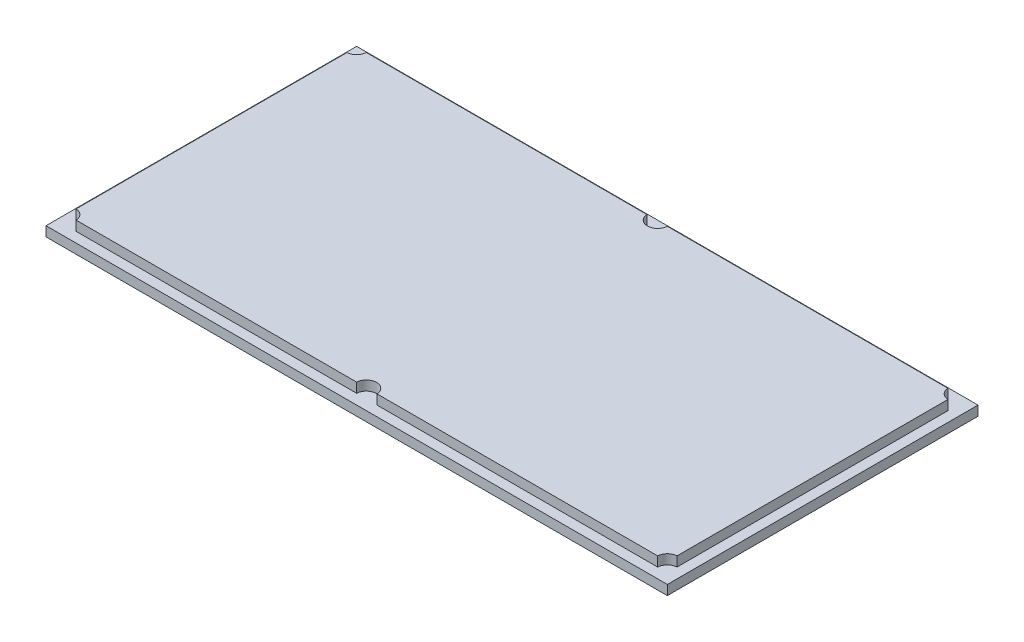
ISO-10303-21;
HEADER;
FILE_DESCRIPTION(('STEP AP214'),'2;1');
FILE_NAME('part.step','',(''),(''),'','','');
FILE_SCHEMA(('AUTOMOTIVE_DESIGN { 1 0 10303 214 1 1 1 1 }'));
ENDSEC;
DATA;
#1=APPLICATION_CONTEXT('core data for automotive mechanical design processes');
#2=APPLICATION_PROTOCOL_DEFINITION('international standard','automotive_design',2000,#1);
#3=PRODUCT_CONTEXT('',#1,'mechanical');
#4=PRODUCT('Part','Part','',(#3));
#5=PRODUCT_RELATED_PRODUCT_CATEGORY('part','',(#4));
#6=PRODUCT_DEFINITION_FORMATION('','',#4);
#7=PRODUCT_DEFINITION_CONTEXT('part definition',#1,'design');
#8=PRODUCT_DEFINITION('design','',#6,#7);
#9=PRODUCT_DEFINITION_SHAPE('','',#8);
#10=(LENGTH_UNIT() NAMED_UNIT(*) SI_UNIT(.MILLI.,.METRE.));
#11=(NAMED_UNIT(*) PLANE_ANGLE_UNIT() SI_UNIT($,.RADIAN.));
#12=(NAMED_UNIT(*) SI_UNIT($,.STERADIAN.) SOLID_ANGLE_UNIT());
#13=UNCERTAINTY_MEASURE_WITH_UNIT(LENGTH_MEASURE(1.E-05),#10,'distance_accuracy_value','');
#14=(GEOMETRIC_REPRESENTATION_CONTEXT(3) GLOBAL_UNCERTAINTY_ASSIGNED_CONTEXT((#13)) GLOBAL_UNIT_ASSIGNED_CONTEXT((#10,
#11,#12)) REPRESENTATION_CONTEXT('',''));
#15=CARTESIAN_POINT('',(0.,0.,0.));
#16=DIRECTION('',(0.,0.,1.));
#17=DIRECTION('',(1.,0.,0.));
#18=AXIS2_PLACEMENT_3D('',#15,#16,#17);
#19=CARTESIAN_POINT('',(0.,2.,136.));
#20=DIRECTION('',(0.,0.,1.));
#21=DIRECTION('',(1.,0.,0.));
#22=AXIS2_PLACEMENT_3D('',#19,#20,#21);
#23=PLANE('',#22);
#24=DIRECTION('',(-1.,0.,0.));
#25=VECTOR('',#24,1.);
#26=CARTESIAN_POINT('',(0.,0.,136.));
#27=LINE('',#26,#25);
#28=CARTESIAN_POINT('',(64.,0.,136.));
#29=VERTEX_POINT('',#28);
#30=CARTESIAN_POINT('',(-64.,0.,136.));
#31=VERTEX_POINT('',#30);
#32=EDGE_CURVE('E164',#29,#31,#27,.T.);
#33=ORIENTED_EDGE('',*,*,#32,.F.);
#34=DIRECTION('',(0.,-1.,0.));
#35=VECTOR('',#34,1.);
#36=CARTESIAN_POINT('',(64.,2.,136.));
#37=LINE('',#36,#35);
#38=CARTESIAN_POINT('',(64.,2.,136.));
#39=VERTEX_POINT('',#38);
#40=EDGE_CURVE('E11',#39,#29,#37,.T.);
#41=ORIENTED_EDGE('',*,*,#40,.F.);
#42=DIRECTION('',(-1.,0.,0.));
#43=VECTOR('',#42,1.);
#44=CARTESIAN_POINT('',(0.,2.,136.));
#45=LINE('',#44,#43);
#46=CARTESIAN_POINT('',(-64.,2.,136.));
#47=VERTEX_POINT('',#46);
#48=EDGE_CURVE('E178',#39,#47,#45,.T.);
#49=ORIENTED_EDGE('',*,*,#48,.T.);
#50=DIRECTION('',(0.,-1.,0.));
#51=VECTOR('',#50,1.);
#52=CARTESIAN_POINT('',(-64.,2.,136.));
#53=LINE('',#52,#51);
#54=EDGE_CURVE('E83',#47,#31,#53,.T.);
#55=ORIENTED_EDGE('',*,*,#54,.T.);
#56=EDGE_LOOP('',(#33,#41,#49,#55));
#57=FACE_BOUND('',#56,.T.);
#58=ADVANCED_FACE('F41',(#57),#23,.T.);
#59=CARTESIAN_POINT('',(64.,2.,0.));
#60=DIRECTION('',(1.,0.,0.));
#61=DIRECTION('',(0.,0.,-1.));
#62=AXIS2_PLACEMENT_3D('',#59,#60,#61);
#63=PLANE('',#62);
#64=DIRECTION('',(0.,0.,1.));
#65=VECTOR('',#64,1.);
#66=CARTESIAN_POINT('',(64.,0.,0.));
#67=LINE('',#66,#65);
#68=CARTESIAN_POINT('',(64.,0.,72.0000000000001));
#69=VERTEX_POINT('',#68);
#70=EDGE_CURVE('E168',#69,#29,#67,.T.);
#71=ORIENTED_EDGE('',*,*,#70,.F.);
#72=DIRECTION('',(0.,-1.,0.));
#73=VECTOR('',#72,1.);
#74=CARTESIAN_POINT('',(64.,2.,72.0000000000001));
#75=LINE('',#74,#73);
#76=CARTESIAN_POINT('',(64.,2.,72.0000000000001));
#77=VERTEX_POINT('',#76);
#78=EDGE_CURVE('E50',#77,#69,#75,.T.);
#79=ORIENTED_EDGE('',*,*,#78,.F.);
#80=DIRECTION('',(0.,0.,1.));
#81=VECTOR('',#80,1.);
#82=CARTESIAN_POINT('',(64.,2.,0.));
#83=LINE('',#82,#81);
#84=EDGE_CURVE('E103',#77,#39,#83,.T.);
#85=ORIENTED_EDGE('',*,*,#84,.T.);
#86=ORIENTED_EDGE('',*,*,#40,.T.);
#87=EDGE_LOOP('',(#71,#79,#85,#86));
#88=FACE_BOUND('',#87,.T.);
#89=ADVANCED_FACE('F185',(#88),#63,.T.);
#90=CARTESIAN_POINT('',(0.,2.,72.0000000000001));
#91=DIRECTION('',(0.,0.,1.));
#92=DIRECTION('',(1.,0.,0.));
#93=AXIS2_PLACEMENT_3D('',#90,#91,#92);
#94=PLANE('',#93);
#95=DIRECTION('',(-1.,0.,0.));
#96=VECTOR('',#95,1.);
#97=CARTESIAN_POINT('',(0.,0.,72.0000000000001));
#98=LINE('',#97,#96);
#99=CARTESIAN_POINT('',(-64.,0.,72.0000000000001));
#100=VERTEX_POINT('',#99);
#101=EDGE_CURVE('E75',#69,#100,#98,.T.);
#102=ORIENTED_EDGE('',*,*,#101,.T.);
#103=DIRECTION('',(0.,-1.,0.));
#104=VECTOR('',#103,1.);
#105=CARTESIAN_POINT('',(-64.,2.,72.0000000000001));
#106=LINE('',#105,#104);
#107=CARTESIAN_POINT('',(-64.,2.,72.0000000000001));
#108=VERTEX_POINT('',#107);
#109=EDGE_CURVE('E106',#108,#100,#106,.T.);
#110=ORIENTED_EDGE('',*,*,#109,.F.);
#111=DIRECTION('',(-1.,0.,0.));
#112=VECTOR('',#111,1.);
#113=CARTESIAN_POINT('',(0.,2.,72.0000000000001));
#114=LINE('',#113,#112);
#115=EDGE_CURVE('E97',#77,#108,#114,.T.);
#116=ORIENTED_EDGE('',*,*,#115,.F.);
#117=ORIENTED_EDGE('',*,*,#78,.T.);
#118=EDGE_LOOP('',(#102,#110,#116,#117));
#119=FACE_BOUND('',#118,.T.);
#120=ADVANCED_FACE('F107',(#119),#94,.F.);
#121=CARTESIAN_POINT('',(-64.,2.,0.));
#122=DIRECTION('',(1.,0.,0.));
#123=DIRECTION('',(0.,0.,-1.));
#124=AXIS2_PLACEMENT_3D('',#121,#122,#123);
#125=PLANE('',#124);
#126=DIRECTION('',(0.,0.,1.));
#127=VECTOR('',#126,1.);
#128=CARTESIAN_POINT('',(-64.,0.,0.));
#129=LINE('',#128,#127);
#130=EDGE_CURVE('E175',#100,#31,#129,.T.);
#131=ORIENTED_EDGE('',*,*,#130,.T.);
#132=ORIENTED_EDGE('',*,*,#54,.F.);
#133=DIRECTION('',(0.,0.,1.));
#134=VECTOR('',#133,1.);
#135=CARTESIAN_POINT('',(-64.,2.,0.));
#136=LINE('',#135,#134);
#137=EDGE_CURVE('E101',#108,#47,#136,.T.);
#138=ORIENTED_EDGE('',*,*,#137,.F.);
#139=ORIENTED_EDGE('',*,*,#109,.T.);
#140=EDGE_LOOP('',(#131,#132,#138,#139));
#141=FACE_BOUND('',#140,.T.);
#142=ADVANCED_FACE('F112',(#141),#125,.F.);
#143=CARTESIAN_POINT('',(0.,2.,0.));
#144=DIRECTION('',(0.,1.,0.));
#145=DIRECTION('',(0.,0.,1.));
#146=AXIS2_PLACEMENT_3D('',#143,#144,#145);
#147=PLANE('',#146);
#148=ORIENTED_EDGE('',*,*,#48,.F.);
#149=ORIENTED_EDGE('',*,*,#84,.F.);
#150=ORIENTED_EDGE('',*,*,#115,.T.);
#151=ORIENTED_EDGE('',*,*,#137,.T.);
#152=EDGE_LOOP('',(#148,#149,#150,#151));
#153=FACE_BOUND('',#152,.T.);
#154=CARTESIAN_POINT('',(-62.,2.,134.));
#155=DIRECTION('',(0.,1.,0.));
#156=DIRECTION('',(0.,0.,1.));
#157=AXIS2_PLACEMENT_3D('',#154,#155,#156);
#158=CIRCLE('',#157,2.10000000000001);
#159=CARTESIAN_POINT('',(-61.9,2.,131.90238230366));
#160=VERTEX_POINT('',#159);
#161=CARTESIAN_POINT('',(-59.9023823036597,2.,133.9));
#162=VERTEX_POINT('',#161);
#163=EDGE_CURVE('E114',#160,#162,#158,.F.);
#164=ORIENTED_EDGE('',*,*,#163,.F.);
#165=DIRECTION('',(0.,0.,1.));
#166=VECTOR('',#165,1.);
#167=CARTESIAN_POINT('',(-61.9,2.,0.));
#168=LINE('',#167,#166);
#169=CARTESIAN_POINT('',(-61.9,2.,76.0976176963403));
#170=VERTEX_POINT('',#169);
#171=EDGE_CURVE('E118',#170,#160,#168,.T.);
#172=ORIENTED_EDGE('',*,*,#171,.F.);
#173=CARTESIAN_POINT('',(-62.,2.,74.0000000000001));
#174=DIRECTION('',(0.,1.,0.));
#175=DIRECTION('',(0.,0.,1.));
#176=AXIS2_PLACEMENT_3D('',#173,#174,#175);
#177=CIRCLE('',#176,2.09999999999998);
#178=CARTESIAN_POINT('',(-59.9023823036597,2.,74.1000000000001));
#179=VERTEX_POINT('',#178);
#180=EDGE_CURVE('E125',#170,#179,#177,.T.);
#181=ORIENTED_EDGE('',*,*,#180,.T.);
#182=DIRECTION('',(-1.,0.,0.));
#183=VECTOR('',#182,1.);
#184=CARTESIAN_POINT('',(0.,2.,74.1000000000001));
#185=LINE('',#184,#183);
#186=CARTESIAN_POINT('',(-2.0976176963403,2.,74.1000000000001));
#187=VERTEX_POINT('',#186);
#188=EDGE_CURVE('E129',#187,#179,#185,.T.);
#189=ORIENTED_EDGE('',*,*,#188,.F.);
#190=CARTESIAN_POINT('',(0.,2.,74.0000000000001));
#191=DIRECTION('',(0.,1.,0.));
#192=DIRECTION('',(0.,0.,1.));
#193=AXIS2_PLACEMENT_3D('',#190,#191,#192);
#194=CIRCLE('',#193,2.1);
#195=CARTESIAN_POINT('',(2.0976176963403,2.,74.1000000000001));
#196=VERTEX_POINT('',#195);
#197=EDGE_CURVE('E132',#196,#187,#194,.F.);
#198=ORIENTED_EDGE('',*,*,#197,.F.);
#199=DIRECTION('',(-1.,0.,0.));
#200=VECTOR('',#199,1.);
#201=CARTESIAN_POINT('',(0.,2.,74.1000000000001));
#202=LINE('',#201,#200);
#203=CARTESIAN_POINT('',(59.9023823036597,2.,74.1000000000001));
#204=VERTEX_POINT('',#203);
#205=EDGE_CURVE('E136',#204,#196,#202,.T.);
#206=ORIENTED_EDGE('',*,*,#205,.F.);
#207=CARTESIAN_POINT('',(62.,2.,74.0000000000001));
#208=DIRECTION('',(0.,1.,0.));
#209=DIRECTION('',(0.,0.,1.));
#210=AXIS2_PLACEMENT_3D('',#207,#208,#209);
#211=CIRCLE('',#210,2.1);
#212=CARTESIAN_POINT('',(61.9,2.,76.0976176963404));
#213=VERTEX_POINT('',#212);
#214=EDGE_CURVE('E140',#213,#204,#211,.F.);
#215=ORIENTED_EDGE('',*,*,#214,.F.);
#216=DIRECTION('',(0.,0.,1.));
#217=VECTOR('',#216,1.);
#218=CARTESIAN_POINT('',(61.9,2.,0.));
#219=LINE('',#218,#217);
#220=CARTESIAN_POINT('',(61.9,2.,131.90238230366));
#221=VERTEX_POINT('',#220);
#222=EDGE_CURVE('E144',#213,#221,#219,.T.);
#223=ORIENTED_EDGE('',*,*,#222,.T.);
#224=CARTESIAN_POINT('',(62.,2.,134.));
#225=DIRECTION('',(0.,1.,0.));
#226=DIRECTION('',(0.,0.,1.));
#227=AXIS2_PLACEMENT_3D('',#224,#225,#226);
#228=CIRCLE('',#227,2.1);
#229=CARTESIAN_POINT('',(59.9023823036597,2.,133.9));
#230=VERTEX_POINT('',#229);
#231=EDGE_CURVE('E148',#221,#230,#228,.T.);
#232=ORIENTED_EDGE('',*,*,#231,.T.);
#233=DIRECTION('',(-1.,0.,0.));
#234=VECTOR('',#233,1.);
#235=CARTESIAN_POINT('',(0.,2.,133.9));
#236=LINE('',#235,#234);
#237=CARTESIAN_POINT('',(2.0976176963403,2.,133.9));
#238=VERTEX_POINT('',#237);
#239=EDGE_CURVE('E152',#230,#238,#236,.T.);
#240=ORIENTED_EDGE('',*,*,#239,.T.);
#241=CARTESIAN_POINT('',(0.,2.,134.));
#242=DIRECTION('',(0.,1.,0.));
#243=DIRECTION('',(0.,0.,1.));
#244=AXIS2_PLACEMENT_3D('',#241,#242,#243);
#245=CIRCLE('',#244,2.1);
#246=CARTESIAN_POINT('',(-2.0976176963403,2.,133.9));
#247=VERTEX_POINT('',#246);
#248=EDGE_CURVE('E156',#238,#247,#245,.T.);
#249=ORIENTED_EDGE('',*,*,#248,.T.);
#250=DIRECTION('',(-1.,0.,0.));
#251=VECTOR('',#250,1.);
#252=CARTESIAN_POINT('',(0.,2.,133.9));
#253=LINE('',#252,#251);
#254=EDGE_CURVE('E160',#247,#162,#253,.T.);
#255=ORIENTED_EDGE('',*,*,#254,.T.);
#256=EDGE_LOOP('',(#164,#172,#181,#189,#198,#206,#215,#223,#232,#240,#249,#255));
#257=FACE_BOUND('',#256,.T.);
#258=ADVANCED_FACE('F98',(#153,#257),#147,.T.);
#259=CARTESIAN_POINT('',(0.,0.,0.));
#260=DIRECTION('',(0.,1.,0.));
#261=DIRECTION('',(0.,0.,1.));
#262=AXIS2_PLACEMENT_3D('',#259,#260,#261);
#263=PLANE('',#262);
#264=ORIENTED_EDGE('',*,*,#32,.T.);
#265=ORIENTED_EDGE('',*,*,#130,.F.);
#266=ORIENTED_EDGE('',*,*,#101,.F.);
#267=ORIENTED_EDGE('',*,*,#70,.T.);
#268=EDGE_LOOP('',(#264,#265,#266,#267));
#269=FACE_BOUND('',#268,.T.);
#270=ADVANCED_FACE('F184',(#269),#263,.F.);
#271=CARTESIAN_POINT('',(-61.9,4.,0.));
#272=DIRECTION('',(1.,0.,0.));
#273=DIRECTION('',(0.,0.,-1.));
#274=AXIS2_PLACEMENT_3D('',#271,#272,#273);
#275=PLANE('',#274);
#276=ORIENTED_EDGE('',*,*,#171,.T.);
#277=DIRECTION('',(0.,-1.,0.));
#278=VECTOR('',#277,1.);
#279=CARTESIAN_POINT('',(-61.9,4.,131.90238230366));
#280=LINE('',#279,#278);
#281=CARTESIAN_POINT('',(-61.9,4.,131.90238230366));
#282=VERTEX_POINT('',#281);
#283=EDGE_CURVE('E169',#282,#160,#280,.T.);
#284=ORIENTED_EDGE('',*,*,#283,.F.);
#285=DIRECTION('',(0.,0.,1.));
#286=VECTOR('',#285,1.);
#287=CARTESIAN_POINT('',(-61.9,4.,0.));
#288=LINE('',#287,#286);
#289=CARTESIAN_POINT('',(-61.9,4.,76.0976176963403));
#290=VERTEX_POINT('',#289);
#291=EDGE_CURVE('E258',#290,#282,#288,.T.);
#292=ORIENTED_EDGE('',*,*,#291,.F.);
#293=DIRECTION('',(0.,-1.,0.));
#294=VECTOR('',#293,1.);
#295=CARTESIAN_POINT('',(-61.9,4.,76.0976176963403));
#296=LINE('',#295,#294);
#297=EDGE_CURVE('E319',#290,#170,#296,.T.);
#298=ORIENTED_EDGE('',*,*,#297,.T.);
#299=EDGE_LOOP('',(#276,#284,#292,#298));
#300=FACE_BOUND('',#299,.T.);
#301=ADVANCED_FACE('F199',(#300),#275,.F.);
#302=CARTESIAN_POINT('',(-62.,4.,134.));
#303=DIRECTION('',(0.,-1.,0.));
#304=DIRECTION('',(0.,0.,-1.));
#305=AXIS2_PLACEMENT_3D('',#302,#303,#304);
#306=CYLINDRICAL_SURFACE('',#305,2.10000000000001);
#307=ORIENTED_EDGE('',*,*,#163,.T.);
#308=DIRECTION('',(0.,-1.,0.));
#309=VECTOR('',#308,1.);
#310=CARTESIAN_POINT('',(-59.9023823036597,4.,133.9));
#311=LINE('',#310,#309);
#312=CARTESIAN_POINT('',(-59.9023823036597,4.,133.9));
#313=VERTEX_POINT('',#312);
#314=EDGE_CURVE('E276',#313,#162,#311,.T.);
#315=ORIENTED_EDGE('',*,*,#314,.F.);
#316=CARTESIAN_POINT('',(-62.,4.,134.));
#317=DIRECTION('',(0.,1.,0.));
#318=DIRECTION('',(0.,0.,1.));
#319=AXIS2_PLACEMENT_3D('',#316,#317,#318);
#320=CIRCLE('',#319,2.10000000000001);
#321=EDGE_CURVE('E263',#282,#313,#320,.F.);
#322=ORIENTED_EDGE('',*,*,#321,.F.);
#323=ORIENTED_EDGE('',*,*,#283,.T.);
#324=EDGE_LOOP('',(#307,#315,#322,#323));
#325=FACE_BOUND('',#324,.T.);
#326=ADVANCED_FACE('F204',(#325),#306,.F.);
#327=CARTESIAN_POINT('',(0.,4.,133.9));
#328=DIRECTION('',(0.,0.,1.));
#329=DIRECTION('',(1.,0.,0.));
#330=AXIS2_PLACEMENT_3D('',#327,#328,#329);
#331=PLANE('',#330);
#332=ORIENTED_EDGE('',*,*,#314,.T.);
#333=ORIENTED_EDGE('',*,*,#254,.F.);
#334=DIRECTION('',(0.,-1.,0.));
#335=VECTOR('',#334,1.);
#336=CARTESIAN_POINT('',(-2.0976176963403,4.,133.9));
#337=LINE('',#336,#335);
#338=CARTESIAN_POINT('',(-2.0976176963403,4.,133.9));
#339=VERTEX_POINT('',#338);
#340=EDGE_CURVE('E280',#339,#247,#337,.T.);
#341=ORIENTED_EDGE('',*,*,#340,.F.);
#342=DIRECTION('',(-1.,0.,0.));
#343=VECTOR('',#342,1.);
#344=CARTESIAN_POINT('',(0.,4.,133.9));
#345=LINE('',#344,#343);
#346=EDGE_CURVE('E355',#339,#313,#345,.T.);
#347=ORIENTED_EDGE('',*,*,#346,.T.);
#348=EDGE_LOOP('',(#332,#333,#341,#347));
#349=FACE_BOUND('',#348,.T.);
#350=ADVANCED_FACE('F208',(#349),#331,.T.);
#351=CARTESIAN_POINT('',(0.,4.,134.));
#352=DIRECTION('',(0.,-1.,0.));
#353=DIRECTION('',(0.,0.,-1.));
#354=AXIS2_PLACEMENT_3D('',#351,#352,#353);
#355=CYLINDRICAL_SURFACE('',#354,2.1);
#356=ORIENTED_EDGE('',*,*,#340,.T.);
#357=ORIENTED_EDGE('',*,*,#248,.F.);
#358=DIRECTION('',(0.,-1.,0.));
#359=VECTOR('',#358,1.);
#360=CARTESIAN_POINT('',(2.0976176963403,4.,133.9));
#361=LINE('',#360,#359);
#362=CARTESIAN_POINT('',(2.0976176963403,4.,133.9));
#363=VERTEX_POINT('',#362);
#364=EDGE_CURVE('E289',#363,#238,#361,.T.);
#365=ORIENTED_EDGE('',*,*,#364,.F.);
#366=CARTESIAN_POINT('',(0.,4.,134.));
#367=DIRECTION('',(0.,1.,0.));
#368=DIRECTION('',(0.,0.,1.));
#369=AXIS2_PLACEMENT_3D('',#366,#367,#368);
#370=CIRCLE('',#369,2.1);
#371=EDGE_CURVE('E351',#363,#339,#370,.T.);
#372=ORIENTED_EDGE('',*,*,#371,.T.);
#373=EDGE_LOOP('',(#356,#357,#365,#372));
#374=FACE_BOUND('',#373,.T.);
#375=ADVANCED_FACE('F212',(#374),#355,.F.);
#376=CARTESIAN_POINT('',(0.,4.,133.9));
#377=DIRECTION('',(0.,0.,1.));
#378=DIRECTION('',(1.,0.,0.));
#379=AXIS2_PLACEMENT_3D('',#376,#377,#378);
#380=PLANE('',#379);
#381=ORIENTED_EDGE('',*,*,#364,.T.);
#382=ORIENTED_EDGE('',*,*,#239,.F.);
#383=DIRECTION('',(0.,-1.,0.));
#384=VECTOR('',#383,1.);
#385=CARTESIAN_POINT('',(59.9023823036597,4.,133.9));
#386=LINE('',#385,#384);
#387=CARTESIAN_POINT('',(59.9023823036597,4.,133.9));
#388=VERTEX_POINT('',#387);
#389=EDGE_CURVE('E293',#388,#230,#386,.T.);
#390=ORIENTED_EDGE('',*,*,#389,.F.);
#391=DIRECTION('',(-1.,0.,0.));
#392=VECTOR('',#391,1.);
#393=CARTESIAN_POINT('',(0.,4.,133.9));
#394=LINE('',#393,#392);
#395=EDGE_CURVE('E347',#388,#363,#394,.T.);
#396=ORIENTED_EDGE('',*,*,#395,.T.);
#397=EDGE_LOOP('',(#381,#382,#390,#396));
#398=FACE_BOUND('',#397,.T.);
#399=ADVANCED_FACE('F216',(#398),#380,.T.);
#400=CARTESIAN_POINT('',(62.,4.,134.));
#401=DIRECTION('',(0.,-1.,0.));
#402=DIRECTION('',(0.,0.,-1.));
#403=AXIS2_PLACEMENT_3D('',#400,#401,#402);
#404=CYLINDRICAL_SURFACE('',#403,2.1);
#405=ORIENTED_EDGE('',*,*,#389,.T.);
#406=ORIENTED_EDGE('',*,*,#231,.F.);
#407=DIRECTION('',(0.,-1.,0.));
#408=VECTOR('',#407,1.);
#409=CARTESIAN_POINT('',(61.9,4.,131.90238230366));
#410=LINE('',#409,#408);
#411=CARTESIAN_POINT('',(61.9,4.,131.90238230366));
#412=VERTEX_POINT('',#411);
#413=EDGE_CURVE('E297',#412,#221,#410,.T.);
#414=ORIENTED_EDGE('',*,*,#413,.F.);
#415=CARTESIAN_POINT('',(62.,4.,134.));
#416=DIRECTION('',(0.,1.,0.));
#417=DIRECTION('',(0.,0.,1.));
#418=AXIS2_PLACEMENT_3D('',#415,#416,#417);
#419=CIRCLE('',#418,2.1);
#420=EDGE_CURVE('E343',#412,#388,#419,.T.);
#421=ORIENTED_EDGE('',*,*,#420,.T.);
#422=EDGE_LOOP('',(#405,#406,#414,#421));
#423=FACE_BOUND('',#422,.T.);
#424=ADVANCED_FACE('F220',(#423),#404,.F.);
#425=CARTESIAN_POINT('',(61.9,4.,0.));
#426=DIRECTION('',(1.,0.,0.));
#427=DIRECTION('',(0.,0.,-1.));
#428=AXIS2_PLACEMENT_3D('',#425,#426,#427);
#429=PLANE('',#428);
#430=ORIENTED_EDGE('',*,*,#413,.T.);
#431=ORIENTED_EDGE('',*,*,#222,.F.);
#432=DIRECTION('',(0.,-1.,0.));
#433=VECTOR('',#432,1.);
#434=CARTESIAN_POINT('',(61.9,4.,76.0976176963404));
#435=LINE('',#434,#433);
#436=CARTESIAN_POINT('',(61.9,4.,76.0976176963404));
#437=VERTEX_POINT('',#436);
#438=EDGE_CURVE('E301',#437,#213,#435,.T.);
#439=ORIENTED_EDGE('',*,*,#438,.F.);
#440=DIRECTION('',(0.,0.,1.));
#441=VECTOR('',#440,1.);
#442=CARTESIAN_POINT('',(61.9,4.,0.));
#443=LINE('',#442,#441);
#444=EDGE_CURVE('E339',#437,#412,#443,.T.);
#445=ORIENTED_EDGE('',*,*,#444,.T.);
#446=EDGE_LOOP('',(#430,#431,#439,#445));
#447=FACE_BOUND('',#446,.T.);
#448=ADVANCED_FACE('F224',(#447),#429,.T.);
#449=CARTESIAN_POINT('',(62.,4.,74.0000000000001));
#450=DIRECTION('',(0.,-1.,0.));
#451=DIRECTION('',(0.,0.,-1.));
#452=AXIS2_PLACEMENT_3D('',#449,#450,#451);
#453=CYLINDRICAL_SURFACE('',#452,2.1);
#454=ORIENTED_EDGE('',*,*,#214,.T.);
#455=DIRECTION('',(0.,-1.,0.));
#456=VECTOR('',#455,1.);
#457=CARTESIAN_POINT('',(59.9023823036597,4.,74.1000000000001));
#458=LINE('',#457,#456);
#459=CARTESIAN_POINT('',(59.9023823036597,4.,74.1000000000001));
#460=VERTEX_POINT('',#459);
#461=EDGE_CURVE('E305',#460,#204,#458,.T.);
#462=ORIENTED_EDGE('',*,*,#461,.F.);
#463=CARTESIAN_POINT('',(62.,4.,74.0000000000001));
#464=DIRECTION('',(0.,1.,0.));
#465=DIRECTION('',(0.,0.,1.));
#466=AXIS2_PLACEMENT_3D('',#463,#464,#465);
#467=CIRCLE('',#466,2.1);
#468=EDGE_CURVE('E335',#437,#460,#467,.F.);
#469=ORIENTED_EDGE('',*,*,#468,.F.);
#470=ORIENTED_EDGE('',*,*,#438,.T.);
#471=EDGE_LOOP('',(#454,#462,#469,#470));
#472=FACE_BOUND('',#471,.T.);
#473=ADVANCED_FACE('F228',(#472),#453,.F.);
#474=CARTESIAN_POINT('',(0.,4.,74.1000000000001));
#475=DIRECTION('',(0.,0.,1.));
#476=DIRECTION('',(1.,0.,0.));
#477=AXIS2_PLACEMENT_3D('',#474,#475,#476);
#478=PLANE('',#477);
#479=ORIENTED_EDGE('',*,*,#205,.T.);
#480=DIRECTION('',(0.,-1.,0.));
#481=VECTOR('',#480,1.);
#482=CARTESIAN_POINT('',(2.0976176963403,4.,74.1000000000001));
#483=LINE('',#482,#481);
#484=CARTESIAN_POINT('',(2.0976176963403,4.,74.1000000000001));
#485=VERTEX_POINT('',#484);
#486=EDGE_CURVE('E309',#485,#196,#483,.T.);
#487=ORIENTED_EDGE('',*,*,#486,.F.);
#488=DIRECTION('',(-1.,0.,0.));
#489=VECTOR('',#488,1.);
#490=CARTESIAN_POINT('',(0.,4.,74.1000000000001));
#491=LINE('',#490,#489);
#492=EDGE_CURVE('E331',#460,#485,#491,.T.);
#493=ORIENTED_EDGE('',*,*,#492,.F.);
#494=ORIENTED_EDGE('',*,*,#461,.T.);
#495=EDGE_LOOP('',(#479,#487,#493,#494));
#496=FACE_BOUND('',#495,.T.);
#497=ADVANCED_FACE('F232',(#496),#478,.F.);
#498=CARTESIAN_POINT('',(0.,4.,74.0000000000001));
#499=DIRECTION('',(0.,-1.,0.));
#500=DIRECTION('',(0.,0.,-1.));
#501=AXIS2_PLACEMENT_3D('',#498,#499,#500);
#502=CYLINDRICAL_SURFACE('',#501,2.1);
#503=ORIENTED_EDGE('',*,*,#197,.T.);
#504=DIRECTION('',(0.,-1.,0.));
#505=VECTOR('',#504,1.);
#506=CARTESIAN_POINT('',(-2.0976176963403,4.,74.1000000000001));
#507=LINE('',#506,#505);
#508=CARTESIAN_POINT('',(-2.0976176963403,4.,74.1000000000001));
#509=VERTEX_POINT('',#508);
#510=EDGE_CURVE('E313',#509,#187,#507,.T.);
#511=ORIENTED_EDGE('',*,*,#510,.F.);
#512=CARTESIAN_POINT('',(0.,4.,74.0000000000001));
#513=DIRECTION('',(0.,1.,0.));
#514=DIRECTION('',(0.,0.,1.));
#515=AXIS2_PLACEMENT_3D('',#512,#513,#514);
#516=CIRCLE('',#515,2.1);
#517=EDGE_CURVE('E327',#485,#509,#516,.F.);
#518=ORIENTED_EDGE('',*,*,#517,.F.);
#519=ORIENTED_EDGE('',*,*,#486,.T.);
#520=EDGE_LOOP('',(#503,#511,#518,#519));
#521=FACE_BOUND('',#520,.T.);
#522=ADVANCED_FACE('F236',(#521),#502,.F.);
#523=CARTESIAN_POINT('',(0.,4.,74.1000000000001));
#524=DIRECTION('',(0.,0.,1.));
#525=DIRECTION('',(1.,0.,0.));
#526=AXIS2_PLACEMENT_3D('',#523,#524,#525);
#527=PLANE('',#526);
#528=ORIENTED_EDGE('',*,*,#188,.T.);
#529=DIRECTION('',(0.,-1.,0.));
#530=VECTOR('',#529,1.);
#531=CARTESIAN_POINT('',(-59.9023823036597,4.,74.1000000000001));
#532=LINE('',#531,#530);
#533=CARTESIAN_POINT('',(-59.9023823036597,4.,74.1000000000001));
#534=VERTEX_POINT('',#533);
#535=EDGE_CURVE('E58',#534,#179,#532,.T.);
#536=ORIENTED_EDGE('',*,*,#535,.F.);
#537=DIRECTION('',(-1.,0.,0.));
#538=VECTOR('',#537,1.);
#539=CARTESIAN_POINT('',(0.,4.,74.1000000000001));
#540=LINE('',#539,#538);
#541=EDGE_CURVE('E324',#509,#534,#540,.T.);
#542=ORIENTED_EDGE('',*,*,#541,.F.);
#543=ORIENTED_EDGE('',*,*,#510,.T.);
#544=EDGE_LOOP('',(#528,#536,#542,#543));
#545=FACE_BOUND('',#544,.T.);
#546=ADVANCED_FACE('F240',(#545),#527,.F.);
#547=CARTESIAN_POINT('',(-62.,4.,74.0000000000001));
#548=DIRECTION('',(0.,-1.,0.));
#549=DIRECTION('',(0.,0.,-1.));
#550=AXIS2_PLACEMENT_3D('',#547,#548,#549);
#551=CYLINDRICAL_SURFACE('',#550,2.09999999999998);
#552=ORIENTED_EDGE('',*,*,#535,.T.);
#553=ORIENTED_EDGE('',*,*,#180,.F.);
#554=ORIENTED_EDGE('',*,*,#297,.F.);
#555=CARTESIAN_POINT('',(-62.,4.,74.0000000000001));
#556=DIRECTION('',(0.,1.,0.));
#557=DIRECTION('',(0.,0.,1.));
#558=AXIS2_PLACEMENT_3D('',#555,#556,#557);
#559=CIRCLE('',#558,2.09999999999998);
#560=EDGE_CURVE('E267',#290,#534,#559,.T.);
#561=ORIENTED_EDGE('',*,*,#560,.T.);
#562=EDGE_LOOP('',(#552,#553,#554,#561));
#563=FACE_BOUND('',#562,.T.);
#564=ADVANCED_FACE('F244',(#563),#551,.F.);
#565=CARTESIAN_POINT('',(0.,4.,0.));
#566=DIRECTION('',(0.,1.,0.));
#567=DIRECTION('',(0.,0.,1.));
#568=AXIS2_PLACEMENT_3D('',#565,#566,#567);
#569=PLANE('',#568);
#570=ORIENTED_EDGE('',*,*,#291,.T.);
#571=ORIENTED_EDGE('',*,*,#321,.T.);
#572=ORIENTED_EDGE('',*,*,#346,.F.);
#573=ORIENTED_EDGE('',*,*,#371,.F.);
#574=ORIENTED_EDGE('',*,*,#395,.F.);
#575=ORIENTED_EDGE('',*,*,#420,.F.);
#576=ORIENTED_EDGE('',*,*,#444,.F.);
#577=ORIENTED_EDGE('',*,*,#468,.T.);
#578=ORIENTED_EDGE('',*,*,#492,.T.);
#579=ORIENTED_EDGE('',*,*,#517,.T.);
#580=ORIENTED_EDGE('',*,*,#541,.T.);
#581=ORIENTED_EDGE('',*,*,#560,.F.);
#582=EDGE_LOOP('',(#570,#571,#572,#573,#574,#575,#576,#577,#578,#579,#580,#581));
#583=FACE_BOUND('',#582,.T.);
#584=ADVANCED_FACE('F248',(#583),#569,.T.);
#585=CLOSED_SHELL('',(#58,#89,#120,#142,#258,#270,#301,#326,#350,#375,#399,#424,#448,#473,#497,
#522,#546,#564,#584));
#586=MANIFOLD_SOLID_BREP('B2',#585);
#587=ADVANCED_BREP_SHAPE_REPRESENTATION('',(#18,#586),#14);
#588=SHAPE_DEFINITION_REPRESENTATION(#9,#587);
ENDSEC;
END-ISO-10303-21;
